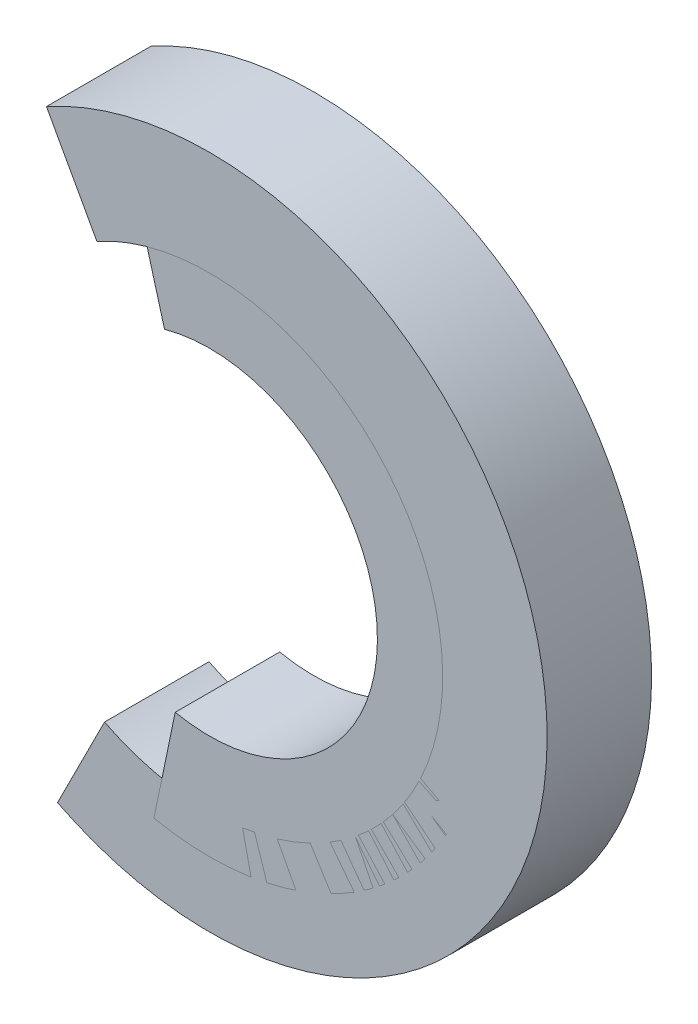
ISO-10303-21;
HEADER;
FILE_DESCRIPTION(('STEP AP214'),'2;1');
FILE_NAME('part.step','',(''),(''),'','','');
FILE_SCHEMA(('AUTOMOTIVE_DESIGN { 1 0 10303 214 1 1 1 1 }'));
ENDSEC;
DATA;
#1=APPLICATION_CONTEXT('core data for automotive mechanical design processes');
#2=APPLICATION_PROTOCOL_DEFINITION('international standard','automotive_design',2000,#1);
#3=PRODUCT_CONTEXT('',#1,'mechanical');
#4=PRODUCT('Part','Part','',(#3));
#5=PRODUCT_RELATED_PRODUCT_CATEGORY('part','',(#4));
#6=PRODUCT_DEFINITION_FORMATION('','',#4);
#7=PRODUCT_DEFINITION_CONTEXT('part definition',#1,'design');
#8=PRODUCT_DEFINITION('design','',#6,#7);
#9=PRODUCT_DEFINITION_SHAPE('','',#8);
#10=(LENGTH_UNIT() NAMED_UNIT(*) SI_UNIT(.MILLI.,.METRE.));
#11=(NAMED_UNIT(*) PLANE_ANGLE_UNIT() SI_UNIT($,.RADIAN.));
#12=(NAMED_UNIT(*) SI_UNIT($,.STERADIAN.) SOLID_ANGLE_UNIT());
#13=UNCERTAINTY_MEASURE_WITH_UNIT(LENGTH_MEASURE(1.E-05),#10,'distance_accuracy_value','');
#14=(GEOMETRIC_REPRESENTATION_CONTEXT(3) GLOBAL_UNCERTAINTY_ASSIGNED_CONTEXT((#13)) GLOBAL_UNIT_ASSIGNED_CONTEXT((#10,
#11,#12)) REPRESENTATION_CONTEXT('',''));
#15=CARTESIAN_POINT('',(0.,0.,0.));
#16=DIRECTION('',(0.,0.,1.));
#17=DIRECTION('',(1.,0.,0.));
#18=AXIS2_PLACEMENT_3D('',#15,#16,#17);
#19=CARTESIAN_POINT('',(61.4765167217312,-27.1113994340747,10.));
#20=DIRECTION('',(0.,0.,-1.));
#21=DIRECTION('',(-1.,0.,0.));
#22=AXIS2_PLACEMENT_3D('',#19,#20,#21);
#23=CYLINDRICAL_SURFACE('',#22,26.0807216396141);
#24=CARTESIAN_POINT('',(61.4765167217312,-27.1113994340747,0.));
#25=DIRECTION('',(0.,0.,1.));
#26=DIRECTION('',(1.,0.,0.));
#27=AXIS2_PLACEMENT_3D('',#24,#25,#26);
#28=CIRCLE('',#27,26.0807216396141);
#29=CARTESIAN_POINT('',(56.1637736679967,-52.6452750209892,0.));
#30=VERTEX_POINT('',#29);
#31=CARTESIAN_POINT('',(54.5046806962151,-1.97979495532419,0.));
#32=VERTEX_POINT('',#31);
#33=EDGE_CURVE('E144',#30,#32,#28,.T.);
#34=ORIENTED_EDGE('',*,*,#33,.T.);
#35=DIRECTION('',(0.,0.,-1.));
#36=VECTOR('',#35,1.);
#37=CARTESIAN_POINT('',(54.5046806962151,-1.97979495532419,10.));
#38=LINE('',#37,#36);
#39=CARTESIAN_POINT('',(54.5046806962151,-1.97979495532419,10.));
#40=VERTEX_POINT('',#39);
#41=EDGE_CURVE('E13',#40,#32,#38,.T.);
#42=ORIENTED_EDGE('',*,*,#41,.F.);
#43=CARTESIAN_POINT('',(61.4765167217312,-27.1113994340747,10.));
#44=DIRECTION('',(0.,0.,1.));
#45=DIRECTION('',(1.,0.,0.));
#46=AXIS2_PLACEMENT_3D('',#43,#44,#45);
#47=CIRCLE('',#46,26.0807216396141);
#48=CARTESIAN_POINT('',(56.1637736679967,-52.6452750209892,10.));
#49=VERTEX_POINT('',#48);
#50=EDGE_CURVE('E121',#49,#40,#47,.T.);
#51=ORIENTED_EDGE('',*,*,#50,.F.);
#52=DIRECTION('',(0.,0.,-1.));
#53=VECTOR('',#52,1.);
#54=CARTESIAN_POINT('',(56.1637736679967,-52.6452750209892,10.));
#55=LINE('',#54,#53);
#56=EDGE_CURVE('E97',#49,#30,#55,.T.);
#57=ORIENTED_EDGE('',*,*,#56,.T.);
#58=EDGE_LOOP('',(#34,#42,#51,#57));
#59=FACE_BOUND('',#58,.T.);
#60=ADVANCED_FACE('F81',(#59),#23,.T.);
#61=CARTESIAN_POINT('',(57.1778567386014,-11.6158797332001,10.));
#62=DIRECTION('',(-0.963608477787593,-0.267317604238625,0.));
#63=DIRECTION('',(0.267317604238625,-0.963608477787593,0.));
#64=AXIS2_PLACEMENT_3D('',#61,#62,#63);
#65=PLANE('',#64);
#66=DIRECTION('',(-0.267317604238625,0.963608477787593,0.));
#67=VECTOR('',#66,1.);
#68=CARTESIAN_POINT('',(57.1778567386014,-11.6158797332001,0.));
#69=LINE('',#68,#67);
#70=CARTESIAN_POINT('',(57.1778567386014,-11.6158797332001,0.));
#71=VERTEX_POINT('',#70);
#72=EDGE_CURVE('E130',#71,#32,#69,.T.);
#73=ORIENTED_EDGE('',*,*,#72,.F.);
#74=DIRECTION('',(0.,0.,-1.));
#75=VECTOR('',#74,1.);
#76=CARTESIAN_POINT('',(57.1778567386014,-11.6158797332001,10.));
#77=LINE('',#76,#75);
#78=CARTESIAN_POINT('',(57.1778567386014,-11.6158797332001,10.));
#79=VERTEX_POINT('',#78);
#80=EDGE_CURVE('E89',#79,#71,#77,.T.);
#81=ORIENTED_EDGE('',*,*,#80,.F.);
#82=DIRECTION('',(-0.267317604238625,0.963608477787593,0.));
#83=VECTOR('',#82,1.);
#84=CARTESIAN_POINT('',(57.1778567386014,-11.6158797332001,10.));
#85=LINE('',#84,#83);
#86=EDGE_CURVE('E128',#79,#40,#85,.T.);
#87=ORIENTED_EDGE('',*,*,#86,.T.);
#88=ORIENTED_EDGE('',*,*,#41,.T.);
#89=EDGE_LOOP('',(#73,#81,#87,#88));
#90=FACE_BOUND('',#89,.T.);
#91=ADVANCED_FACE('F127',(#90),#65,.T.);
#92=CARTESIAN_POINT('',(61.4765167217312,-27.1113994340747,10.));
#93=DIRECTION('',(0.,0.,-1.));
#94=DIRECTION('',(-1.,0.,0.));
#95=AXIS2_PLACEMENT_3D('',#92,#93,#94);
#96=CYLINDRICAL_SURFACE('',#95,16.0807216396141);
#97=CARTESIAN_POINT('',(61.4765167217312,-27.1113994340747,0.));
#98=DIRECTION('',(0.,0.,1.));
#99=DIRECTION('',(1.,0.,0.));
#100=AXIS2_PLACEMENT_3D('',#97,#98,#99);
#101=CIRCLE('',#100,16.0807216396141);
#102=CARTESIAN_POINT('',(58.2008120318681,-42.8549494541801,0.));
#103=VERTEX_POINT('',#102);
#104=EDGE_CURVE('E147',#103,#71,#101,.T.);
#105=ORIENTED_EDGE('',*,*,#104,.F.);
#106=DIRECTION('',(0.,0.,-1.));
#107=VECTOR('',#106,1.);
#108=CARTESIAN_POINT('',(58.2008120318681,-42.8549494541801,10.));
#109=LINE('',#108,#107);
#110=CARTESIAN_POINT('',(58.2008120318681,-42.8549494541801,10.));
#111=VERTEX_POINT('',#110);
#112=EDGE_CURVE('E110',#111,#103,#109,.T.);
#113=ORIENTED_EDGE('',*,*,#112,.F.);
#114=CARTESIAN_POINT('',(61.4765167217312,-27.1113994340747,10.));
#115=DIRECTION('',(0.,0.,1.));
#116=DIRECTION('',(1.,0.,0.));
#117=AXIS2_PLACEMENT_3D('',#114,#115,#116);
#118=CIRCLE('',#117,16.0807216396141);
#119=EDGE_CURVE('E136',#111,#79,#118,.T.);
#120=ORIENTED_EDGE('',*,*,#119,.T.);
#121=ORIENTED_EDGE('',*,*,#80,.T.);
#122=EDGE_LOOP('',(#105,#113,#120,#121));
#123=FACE_BOUND('',#122,.T.);
#124=ADVANCED_FACE('F138',(#123),#96,.F.);
#125=CARTESIAN_POINT('',(56.1637736679967,-52.6452750209892,10.));
#126=DIRECTION('',(-0.97903255668091,0.203703836387143,0.));
#127=DIRECTION('',(-0.203703836387143,-0.979032556680911,0.));
#128=AXIS2_PLACEMENT_3D('',#125,#126,#127);
#129=PLANE('',#128);
#130=DIRECTION('',(0.203703836387143,0.97903255668091,0.));
#131=VECTOR('',#130,1.);
#132=CARTESIAN_POINT('',(56.1637736679967,-52.6452750209892,0.));
#133=LINE('',#132,#131);
#134=EDGE_CURVE('E149',#30,#103,#133,.T.);
#135=ORIENTED_EDGE('',*,*,#134,.F.);
#136=ORIENTED_EDGE('',*,*,#56,.F.);
#137=DIRECTION('',(0.203703836387143,0.97903255668091,0.));
#138=VECTOR('',#137,1.);
#139=CARTESIAN_POINT('',(56.1637736679967,-52.6452750209892,10.));
#140=LINE('',#139,#138);
#141=EDGE_CURVE('E139',#49,#111,#140,.T.);
#142=ORIENTED_EDGE('',*,*,#141,.T.);
#143=ORIENTED_EDGE('',*,*,#112,.T.);
#144=EDGE_LOOP('',(#135,#136,#142,#143));
#145=FACE_BOUND('',#144,.T.);
#146=ADVANCED_FACE('F155',(#145),#129,.T.);
#147=CARTESIAN_POINT('',(61.4765167217312,-27.1113994340747,10.));
#148=DIRECTION('',(0.,0.,1.));
#149=DIRECTION('',(1.,0.,0.));
#150=AXIS2_PLACEMENT_3D('',#147,#148,#149);
#151=PLANE('',#150);
#152=ORIENTED_EDGE('',*,*,#50,.T.);
#153=ORIENTED_EDGE('',*,*,#86,.F.);
#154=ORIENTED_EDGE('',*,*,#119,.F.);
#155=ORIENTED_EDGE('',*,*,#141,.F.);
#156=EDGE_LOOP('',(#152,#153,#154,#155));
#157=FACE_BOUND('',#156,.T.);
#158=ADVANCED_FACE('F135',(#157),#151,.T.);
#159=CARTESIAN_POINT('',(61.4765167217312,-27.1113994340747,0.));
#160=DIRECTION('',(0.,0.,1.));
#161=DIRECTION('',(1.,0.,0.));
#162=AXIS2_PLACEMENT_3D('',#159,#160,#161);
#163=PLANE('',#162);
#164=ORIENTED_EDGE('',*,*,#33,.F.);
#165=ORIENTED_EDGE('',*,*,#134,.T.);
#166=ORIENTED_EDGE('',*,*,#104,.T.);
#167=ORIENTED_EDGE('',*,*,#72,.T.);
#168=EDGE_LOOP('',(#164,#165,#166,#167));
#169=FACE_BOUND('',#168,.T.);
#170=ADVANCED_FACE('F154',(#169),#163,.F.);
#171=CLOSED_SHELL('',(#60,#91,#124,#146,#158,#170));
#172=MANIFOLD_SOLID_BREP('B2',#171);
#173=CARTESIAN_POINT('',(61.4765167217312,-27.1113994340747,10.));
#174=DIRECTION('',(0.,0.,-1.));
#175=DIRECTION('',(-1.,0.,0.));
#176=AXIS2_PLACEMENT_3D('',#173,#174,#175);
#177=CYLINDRICAL_SURFACE('',#176,32.3253164490187);
#178=CARTESIAN_POINT('',(61.4765167217312,-27.1113994340747,0.));
#179=DIRECTION('',(0.,0.,1.));
#180=DIRECTION('',(1.,0.,0.));
#181=AXIS2_PLACEMENT_3D('',#178,#179,#180);
#182=CIRCLE('',#181,32.3253164490187);
#183=CARTESIAN_POINT('',(46.9305735617414,-55.9790564417977,0.));
#184=VERTEX_POINT('',#183);
#185=CARTESIAN_POINT('',(45.8724674944023,1.19831146590261,0.));
#186=VERTEX_POINT('',#185);
#187=EDGE_CURVE('E273',#184,#186,#182,.T.);
#188=ORIENTED_EDGE('',*,*,#187,.T.);
#189=DIRECTION('',(0.,0.,-1.));
#190=VECTOR('',#189,1.);
#191=CARTESIAN_POINT('',(45.8724674944023,1.19831146590261,10.));
#192=LINE('',#191,#190);
#193=CARTESIAN_POINT('',(45.8724674944023,1.19831146590261,10.));
#194=VERTEX_POINT('',#193);
#195=EDGE_CURVE('E79',#194,#186,#192,.T.);
#196=ORIENTED_EDGE('',*,*,#195,.F.);
#197=CARTESIAN_POINT('',(61.4765167217312,-27.1113994340747,10.));
#198=DIRECTION('',(0.,0.,1.));
#199=DIRECTION('',(1.,0.,0.));
#200=AXIS2_PLACEMENT_3D('',#197,#198,#199);
#201=CIRCLE('',#200,32.3253164490187);
#202=CARTESIAN_POINT('',(46.9305735617414,-55.9790564417977,10.));
#203=VERTEX_POINT('',#202);
#204=EDGE_CURVE('E246',#203,#194,#201,.T.);
#205=ORIENTED_EDGE('',*,*,#204,.F.);
#206=DIRECTION('',(0.,0.,-1.));
#207=VECTOR('',#206,1.);
#208=CARTESIAN_POINT('',(46.9305735617414,-55.9790564417977,10.));
#209=LINE('',#208,#207);
#210=EDGE_CURVE('E222',#203,#184,#209,.T.);
#211=ORIENTED_EDGE('',*,*,#210,.T.);
#212=EDGE_LOOP('',(#188,#196,#205,#211));
#213=FACE_BOUND('',#212,.T.);
#214=ADVANCED_FACE('F205',(#213),#177,.T.);
#215=CARTESIAN_POINT('',(50.6996589781852,-7.55944066457552,10.));
#216=DIRECTION('',(-0.875775213047813,-0.482719148378287,0.));
#217=DIRECTION('',(0.482719148378287,-0.875775213047813,0.));
#218=AXIS2_PLACEMENT_3D('',#215,#216,#217);
#219=PLANE('',#218);
#220=DIRECTION('',(-0.482719148378287,0.875775213047812,0.));
#221=VECTOR('',#220,1.);
#222=CARTESIAN_POINT('',(50.6996589781852,-7.55944066457552,0.));
#223=LINE('',#222,#221);
#224=CARTESIAN_POINT('',(50.6996589781852,-7.55944066457552,0.));
#225=VERTEX_POINT('',#224);
#226=EDGE_CURVE('E255',#225,#186,#223,.T.);
#227=ORIENTED_EDGE('',*,*,#226,.F.);
#228=DIRECTION('',(0.,0.,-1.));
#229=VECTOR('',#228,1.);
#230=CARTESIAN_POINT('',(50.6996589781852,-7.55944066457552,10.));
#231=LINE('',#230,#229);
#232=CARTESIAN_POINT('',(50.6996589781852,-7.55944066457552,10.));
#233=VERTEX_POINT('',#232);
#234=EDGE_CURVE('E214',#233,#225,#231,.T.);
#235=ORIENTED_EDGE('',*,*,#234,.F.);
#236=DIRECTION('',(-0.482719148378287,0.875775213047812,0.));
#237=VECTOR('',#236,1.);
#238=CARTESIAN_POINT('',(50.6996589781852,-7.55944066457552,10.));
#239=LINE('',#238,#237);
#240=EDGE_CURVE('E253',#233,#194,#239,.T.);
#241=ORIENTED_EDGE('',*,*,#240,.T.);
#242=ORIENTED_EDGE('',*,*,#195,.T.);
#243=EDGE_LOOP('',(#227,#235,#241,#242));
#244=FACE_BOUND('',#243,.T.);
#245=ADVANCED_FACE('F252',(#244),#219,.T.);
#246=CARTESIAN_POINT('',(61.4765167217312,-27.1113994340747,10.));
#247=DIRECTION('',(0.,0.,-1.));
#248=DIRECTION('',(-1.,0.,0.));
#249=AXIS2_PLACEMENT_3D('',#246,#247,#248);
#250=CYLINDRICAL_SURFACE('',#249,22.3253164490187);
#251=CARTESIAN_POINT('',(61.4765167217312,-27.1113994340747,0.));
#252=DIRECTION('',(0.,0.,1.));
#253=DIRECTION('',(1.,0.,0.));
#254=AXIS2_PLACEMENT_3D('',#251,#252,#253);
#255=CIRCLE('',#254,22.3253164490187);
#256=CARTESIAN_POINT('',(51.4304345864373,-47.048700863299,0.));
#257=VERTEX_POINT('',#256);
#258=EDGE_CURVE('E278',#257,#225,#255,.T.);
#259=ORIENTED_EDGE('',*,*,#258,.F.);
#260=DIRECTION('',(0.,0.,-1.));
#261=VECTOR('',#260,1.);
#262=CARTESIAN_POINT('',(51.4304345864373,-47.048700863299,10.));
#263=LINE('',#262,#261);
#264=CARTESIAN_POINT('',(51.4304345864373,-47.048700863299,10.));
#265=VERTEX_POINT('',#264);
#266=EDGE_CURVE('E235',#265,#257,#263,.T.);
#267=ORIENTED_EDGE('',*,*,#266,.F.);
#268=CARTESIAN_POINT('',(61.4765167217312,-27.1113994340747,10.));
#269=DIRECTION('',(0.,0.,1.));
#270=DIRECTION('',(1.,0.,0.));
#271=AXIS2_PLACEMENT_3D('',#268,#269,#270);
#272=CIRCLE('',#271,22.3253164490187);
#273=EDGE_CURVE('E262',#265,#233,#272,.T.);
#274=ORIENTED_EDGE('',*,*,#273,.T.);
#275=ORIENTED_EDGE('',*,*,#234,.T.);
#276=EDGE_LOOP('',(#259,#267,#274,#275));
#277=FACE_BOUND('',#276,.T.);
#278=ADVANCED_FACE('F265',(#277),#250,.F.);
#279=CARTESIAN_POINT('',(46.9305735617414,-55.9790564417977,10.));
#280=DIRECTION('',(-0.893035557849872,0.449986102469585,0.));
#281=DIRECTION('',(-0.449986102469585,-0.893035557849872,0.));
#282=AXIS2_PLACEMENT_3D('',#279,#280,#281);
#283=PLANE('',#282);
#284=DIRECTION('',(0.449986102469585,0.893035557849872,0.));
#285=VECTOR('',#284,1.);
#286=CARTESIAN_POINT('',(46.9305735617414,-55.9790564417977,0.));
#287=LINE('',#286,#285);
#288=EDGE_CURVE('E281',#184,#257,#287,.T.);
#289=ORIENTED_EDGE('',*,*,#288,.F.);
#290=ORIENTED_EDGE('',*,*,#210,.F.);
#291=DIRECTION('',(0.449986102469585,0.893035557849872,0.));
#292=VECTOR('',#291,1.);
#293=CARTESIAN_POINT('',(46.9305735617414,-55.9790564417977,10.));
#294=LINE('',#293,#292);
#295=EDGE_CURVE('E267',#203,#265,#294,.T.);
#296=ORIENTED_EDGE('',*,*,#295,.T.);
#297=ORIENTED_EDGE('',*,*,#266,.T.);
#298=EDGE_LOOP('',(#289,#290,#296,#297));
#299=FACE_BOUND('',#298,.T.);
#300=ADVANCED_FACE('F291',(#299),#283,.T.);
#301=CARTESIAN_POINT('',(61.4765167217312,-27.1113994340747,10.));
#302=DIRECTION('',(0.,0.,1.));
#303=DIRECTION('',(1.,0.,0.));
#304=AXIS2_PLACEMENT_3D('',#301,#302,#303);
#305=PLANE('',#304);
#306=ORIENTED_EDGE('',*,*,#204,.T.);
#307=ORIENTED_EDGE('',*,*,#240,.F.);
#308=ORIENTED_EDGE('',*,*,#273,.F.);
#309=ORIENTED_EDGE('',*,*,#295,.F.);
#310=EDGE_LOOP('',(#306,#307,#308,#309));
#311=FACE_BOUND('',#310,.T.);
#312=ADVANCED_FACE('F261',(#311),#305,.T.);
#313=CARTESIAN_POINT('',(61.4765167217312,-27.1113994340747,0.));
#314=DIRECTION('',(0.,0.,1.));
#315=DIRECTION('',(1.,0.,0.));
#316=AXIS2_PLACEMENT_3D('',#313,#314,#315);
#317=PLANE('',#316);
#318=ORIENTED_EDGE('',*,*,#187,.F.);
#319=ORIENTED_EDGE('',*,*,#288,.T.);
#320=ORIENTED_EDGE('',*,*,#258,.T.);
#321=ORIENTED_EDGE('',*,*,#226,.T.);
#322=EDGE_LOOP('',(#318,#319,#320,#321));
#323=FACE_BOUND('',#322,.T.);
#324=ADVANCED_FACE('F290',(#323),#317,.F.);
#325=CLOSED_SHELL('',(#214,#245,#278,#300,#312,#324));
#326=MANIFOLD_SOLID_BREP('B7',#325);
#327=ADVANCED_BREP_SHAPE_REPRESENTATION('',(#18,#172,#326),#14);
#328=SHAPE_DEFINITION_REPRESENTATION(#9,#327);
ENDSEC;
END-ISO-10303-21;
